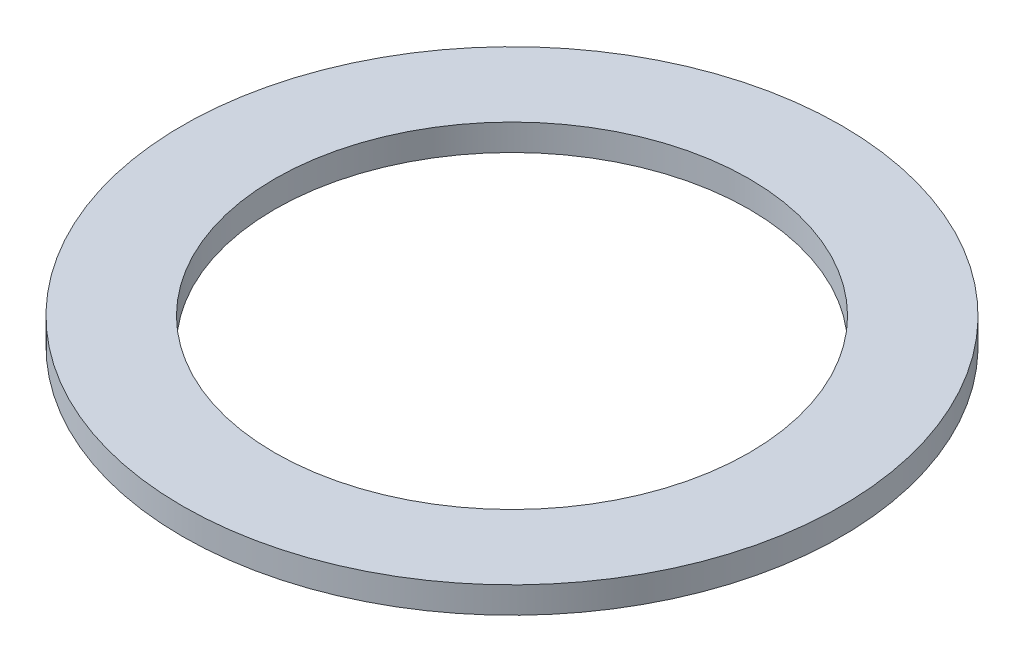
ISO-10303-21;
HEADER;
FILE_DESCRIPTION(('STEP AP214'),'2;1');
FILE_NAME('part.step','',(''),(''),'','','');
FILE_SCHEMA(('AUTOMOTIVE_DESIGN { 1 0 10303 214 1 1 1 1 }'));
ENDSEC;
DATA;
#1=APPLICATION_CONTEXT('core data for automotive mechanical design processes');
#2=APPLICATION_PROTOCOL_DEFINITION('international standard','automotive_design',2000,#1);
#3=PRODUCT_CONTEXT('',#1,'mechanical');
#4=PRODUCT('Part','Part','',(#3));
#5=PRODUCT_RELATED_PRODUCT_CATEGORY('part','',(#4));
#6=PRODUCT_DEFINITION_FORMATION('','',#4);
#7=PRODUCT_DEFINITION_CONTEXT('part definition',#1,'design');
#8=PRODUCT_DEFINITION('design','',#6,#7);
#9=PRODUCT_DEFINITION_SHAPE('','',#8);
#10=(LENGTH_UNIT() NAMED_UNIT(*) SI_UNIT(.MILLI.,.METRE.));
#11=(NAMED_UNIT(*) PLANE_ANGLE_UNIT() SI_UNIT($,.RADIAN.));
#12=(NAMED_UNIT(*) SI_UNIT($,.STERADIAN.) SOLID_ANGLE_UNIT());
#13=UNCERTAINTY_MEASURE_WITH_UNIT(LENGTH_MEASURE(1.E-05),#10,'distance_accuracy_value','');
#14=(GEOMETRIC_REPRESENTATION_CONTEXT(3) GLOBAL_UNCERTAINTY_ASSIGNED_CONTEXT((#13)) GLOBAL_UNIT_ASSIGNED_CONTEXT((#10,
#11,#12)) REPRESENTATION_CONTEXT('',''));
#15=CARTESIAN_POINT('',(0.,0.,0.));
#16=DIRECTION('',(0.,0.,1.));
#17=DIRECTION('',(1.,0.,0.));
#18=AXIS2_PLACEMENT_3D('',#15,#16,#17);
#19=CARTESIAN_POINT('',(0.,5.,0.));
#20=DIRECTION('',(0.,-1.,0.));
#21=DIRECTION('',(0.,0.,-1.));
#22=AXIS2_PLACEMENT_3D('',#19,#20,#21);
#23=CYLINDRICAL_SURFACE('',#22,62.5);
#24=CARTESIAN_POINT('',(0.,5.,0.));
#25=DIRECTION('',(0.,1.,0.));
#26=DIRECTION('',(0.,0.,1.));
#27=AXIS2_PLACEMENT_3D('',#24,#25,#26);
#28=CIRCLE('',#27,62.5);
#29=CARTESIAN_POINT('',(0.,5.,62.5));
#30=VERTEX_POINT('',#29);
#31=EDGE_CURVE('E10',#30,#30,#28,.T.);
#32=ORIENTED_EDGE('',*,*,#31,.F.);
#33=EDGE_LOOP('',(#32));
#34=FACE_BOUND('',#33,.T.);
#35=CARTESIAN_POINT('',(0.,0.,0.));
#36=DIRECTION('',(0.,1.,0.));
#37=DIRECTION('',(0.,0.,1.));
#38=AXIS2_PLACEMENT_3D('',#35,#36,#37);
#39=CIRCLE('',#38,62.5);
#40=CARTESIAN_POINT('',(0.,0.,62.5));
#41=VERTEX_POINT('',#40);
#42=EDGE_CURVE('E37',#41,#41,#39,.T.);
#43=ORIENTED_EDGE('',*,*,#42,.T.);
#44=EDGE_LOOP('',(#43));
#45=FACE_BOUND('',#44,.T.);
#46=ADVANCED_FACE('F40',(#34,#45),#23,.T.);
#47=CARTESIAN_POINT('',(0.,5.,0.));
#48=DIRECTION('',(0.,1.,0.));
#49=DIRECTION('',(0.,0.,1.));
#50=AXIS2_PLACEMENT_3D('',#47,#48,#49);
#51=PLANE('',#50);
#52=CARTESIAN_POINT('',(0.,5.,0.));
#53=DIRECTION('',(0.,1.,0.));
#54=DIRECTION('',(0.,0.,1.));
#55=AXIS2_PLACEMENT_3D('',#52,#53,#54);
#56=CIRCLE('',#55,45.);
#57=CARTESIAN_POINT('',(0.,5.,45.));
#58=VERTEX_POINT('',#57);
#59=EDGE_CURVE('E50',#58,#58,#56,.T.);
#60=ORIENTED_EDGE('',*,*,#59,.F.);
#61=EDGE_LOOP('',(#60));
#62=FACE_BOUND('',#61,.T.);
#63=ORIENTED_EDGE('',*,*,#31,.T.);
#64=EDGE_LOOP('',(#63));
#65=FACE_BOUND('',#64,.T.);
#66=ADVANCED_FACE('F59',(#62,#65),#51,.T.);
#67=CARTESIAN_POINT('',(0.,0.,0.));
#68=DIRECTION('',(0.,1.,0.));
#69=DIRECTION('',(0.,0.,1.));
#70=AXIS2_PLACEMENT_3D('',#67,#68,#69);
#71=PLANE('',#70);
#72=CARTESIAN_POINT('',(0.,0.,0.));
#73=DIRECTION('',(0.,1.,0.));
#74=DIRECTION('',(0.,0.,1.));
#75=AXIS2_PLACEMENT_3D('',#72,#73,#74);
#76=CIRCLE('',#75,45.);
#77=CARTESIAN_POINT('',(0.,0.,45.));
#78=VERTEX_POINT('',#77);
#79=EDGE_CURVE('E47',#78,#78,#76,.T.);
#80=ORIENTED_EDGE('',*,*,#79,.T.);
#81=EDGE_LOOP('',(#80));
#82=FACE_BOUND('',#81,.T.);
#83=ORIENTED_EDGE('',*,*,#42,.F.);
#84=EDGE_LOOP('',(#83));
#85=FACE_BOUND('',#84,.T.);
#86=ADVANCED_FACE('F58',(#82,#85),#71,.F.);
#87=CARTESIAN_POINT('',(0.,5.,0.));
#88=DIRECTION('',(0.,-1.,0.));
#89=DIRECTION('',(0.,0.,-1.));
#90=AXIS2_PLACEMENT_3D('',#87,#88,#89);
#91=CYLINDRICAL_SURFACE('',#90,45.);
#92=ORIENTED_EDGE('',*,*,#59,.T.);
#93=EDGE_LOOP('',(#92));
#94=FACE_BOUND('',#93,.T.);
#95=ORIENTED_EDGE('',*,*,#79,.F.);
#96=EDGE_LOOP('',(#95));
#97=FACE_BOUND('',#96,.T.);
#98=ADVANCED_FACE('F54',(#94,#97),#91,.F.);
#99=CLOSED_SHELL('',(#46,#66,#86,#98));
#100=MANIFOLD_SOLID_BREP('B2',#99);
#101=ADVANCED_BREP_SHAPE_REPRESENTATION('',(#18,#100),#14);
#102=SHAPE_DEFINITION_REPRESENTATION(#9,#101);
ENDSEC;
END-ISO-10303-21;
